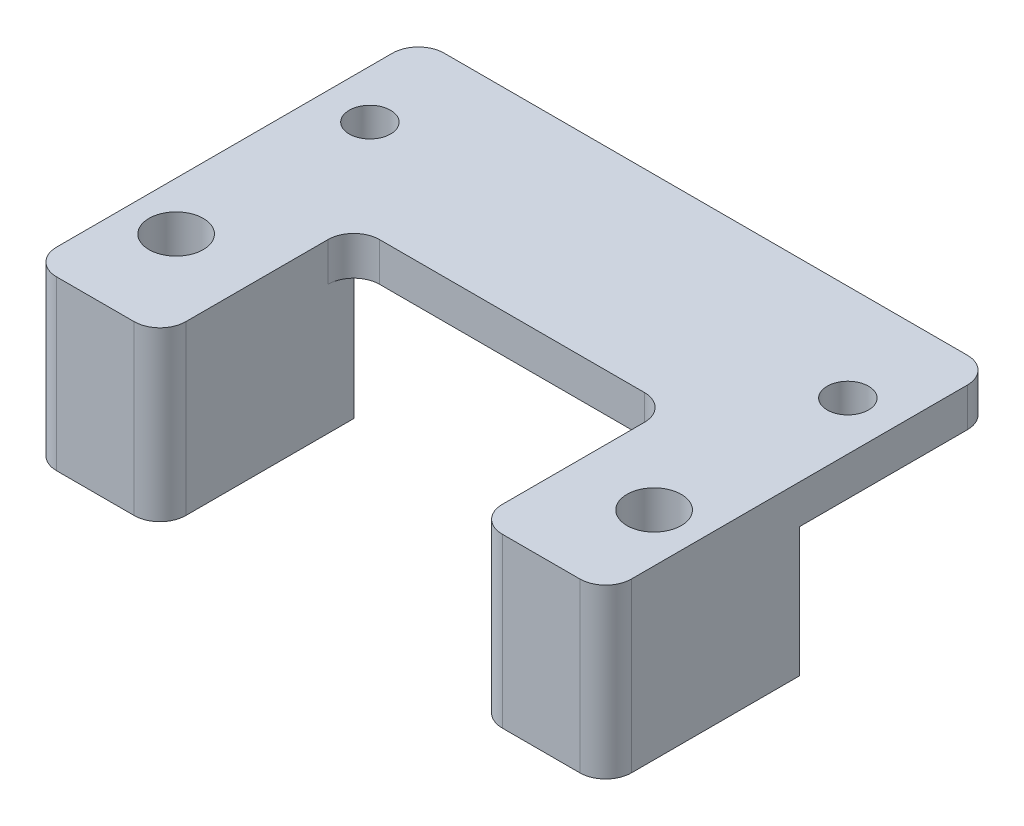
ISO-10303-21;
HEADER;
FILE_DESCRIPTION(('STEP AP214'),'2;1');
FILE_NAME('part.step','',(''),(''),'','','');
FILE_SCHEMA(('AUTOMOTIVE_DESIGN { 1 0 10303 214 1 1 1 1 }'));
ENDSEC;
DATA;
#1=APPLICATION_CONTEXT('core data for automotive mechanical design processes');
#2=APPLICATION_PROTOCOL_DEFINITION('international standard','automotive_design',2000,#1);
#3=PRODUCT_CONTEXT('',#1,'mechanical');
#4=PRODUCT('Part','Part','',(#3));
#5=PRODUCT_RELATED_PRODUCT_CATEGORY('part','',(#4));
#6=PRODUCT_DEFINITION_FORMATION('','',#4);
#7=PRODUCT_DEFINITION_CONTEXT('part definition',#1,'design');
#8=PRODUCT_DEFINITION('design','',#6,#7);
#9=PRODUCT_DEFINITION_SHAPE('','',#8);
#10=(LENGTH_UNIT() NAMED_UNIT(*) SI_UNIT(.MILLI.,.METRE.));
#11=(NAMED_UNIT(*) PLANE_ANGLE_UNIT() SI_UNIT($,.RADIAN.));
#12=(NAMED_UNIT(*) SI_UNIT($,.STERADIAN.) SOLID_ANGLE_UNIT());
#13=UNCERTAINTY_MEASURE_WITH_UNIT(LENGTH_MEASURE(1.E-05),#10,'distance_accuracy_value','');
#14=(GEOMETRIC_REPRESENTATION_CONTEXT(3) GLOBAL_UNCERTAINTY_ASSIGNED_CONTEXT((#13)) GLOBAL_UNIT_ASSIGNED_CONTEXT((#10,
#11,#12)) REPRESENTATION_CONTEXT('',''));
#15=CARTESIAN_POINT('',(0.,0.,0.));
#16=DIRECTION('',(0.,0.,1.));
#17=DIRECTION('',(1.,0.,0.));
#18=AXIS2_PLACEMENT_3D('',#15,#16,#17);
#19=CARTESIAN_POINT('',(0.,3.,0.));
#20=DIRECTION('',(0.,0.,-1.));
#21=DIRECTION('',(-1.,0.,0.));
#22=AXIS2_PLACEMENT_3D('',#19,#20,#21);
#23=PLANE('',#22);
#24=DIRECTION('',(-1.,0.,0.));
#25=VECTOR('',#24,1.);
#26=CARTESIAN_POINT('',(0.,-10.,0.));
#27=LINE('',#26,#25);
#28=CARTESIAN_POINT('',(8.,-10.,0.));
#29=VERTEX_POINT('',#28);
#30=CARTESIAN_POINT('',(2.,-10.,0.));
#31=VERTEX_POINT('',#30);
#32=EDGE_CURVE('E367',#29,#31,#27,.T.);
#33=ORIENTED_EDGE('',*,*,#32,.F.);
#34=DIRECTION('',(0.,1.,0.));
#35=VECTOR('',#34,1.);
#36=CARTESIAN_POINT('',(8.,3.,0.));
#37=LINE('',#36,#35);
#38=CARTESIAN_POINT('',(8.,3.,0.));
#39=VERTEX_POINT('',#38);
#40=EDGE_CURVE('E287',#29,#39,#37,.T.);
#41=ORIENTED_EDGE('',*,*,#40,.T.);
#42=DIRECTION('',(1.,0.,0.));
#43=VECTOR('',#42,1.);
#44=CARTESIAN_POINT('',(0.,3.,0.));
#45=LINE('',#44,#43);
#46=CARTESIAN_POINT('',(2.,3.,0.));
#47=VERTEX_POINT('',#46);
#48=EDGE_CURVE('E231',#47,#39,#45,.T.);
#49=ORIENTED_EDGE('',*,*,#48,.F.);
#50=DIRECTION('',(0.,-1.,0.));
#51=VECTOR('',#50,1.);
#52=CARTESIAN_POINT('',(2.,3.,0.));
#53=LINE('',#52,#51);
#54=EDGE_CURVE('E284',#47,#31,#53,.T.);
#55=ORIENTED_EDGE('',*,*,#54,.T.);
#56=EDGE_LOOP('',(#33,#41,#49,#55));
#57=FACE_BOUND('',#56,.T.);
#58=ADVANCED_FACE('F41',(#57),#23,.F.);
#59=CARTESIAN_POINT('',(0.,3.,0.));
#60=DIRECTION('',(1.,0.,0.));
#61=DIRECTION('',(0.,0.,-1.));
#62=AXIS2_PLACEMENT_3D('',#59,#60,#61);
#63=PLANE('',#62);
#64=DIRECTION('',(0.,0.,-1.));
#65=VECTOR('',#64,1.);
#66=CARTESIAN_POINT('',(0.,-10.,0.));
#67=LINE('',#66,#65);
#68=CARTESIAN_POINT('',(0.,-10.,-2.));
#69=VERTEX_POINT('',#68);
#70=CARTESIAN_POINT('',(0.,-10.,-15.));
#71=VERTEX_POINT('',#70);
#72=EDGE_CURVE('E360',#69,#71,#67,.T.);
#73=ORIENTED_EDGE('',*,*,#72,.F.);
#74=DIRECTION('',(0.,-1.,0.));
#75=VECTOR('',#74,1.);
#76=CARTESIAN_POINT('',(0.,3.,-2.));
#77=LINE('',#76,#75);
#78=CARTESIAN_POINT('',(0.,3.,-2.));
#79=VERTEX_POINT('',#78);
#80=EDGE_CURVE('E302',#69,#79,#77,.F.);
#81=ORIENTED_EDGE('',*,*,#80,.T.);
#82=DIRECTION('',(0.,0.,1.));
#83=VECTOR('',#82,1.);
#84=CARTESIAN_POINT('',(0.,3.,0.));
#85=LINE('',#84,#83);
#86=CARTESIAN_POINT('',(0.,3.,-28.));
#87=VERTEX_POINT('',#86);
#88=EDGE_CURVE('E224',#87,#79,#85,.T.);
#89=ORIENTED_EDGE('',*,*,#88,.F.);
#90=DIRECTION('',(0.,-1.,0.));
#91=VECTOR('',#90,1.);
#92=CARTESIAN_POINT('',(0.,3.,-28.));
#93=LINE('',#92,#91);
#94=CARTESIAN_POINT('',(0.,0.,-28.));
#95=VERTEX_POINT('',#94);
#96=EDGE_CURVE('E299',#87,#95,#93,.T.);
#97=ORIENTED_EDGE('',*,*,#96,.T.);
#98=DIRECTION('',(0.,0.,1.));
#99=VECTOR('',#98,1.);
#100=CARTESIAN_POINT('',(0.,0.,0.));
#101=LINE('',#100,#99);
#102=CARTESIAN_POINT('',(0.,0.,-15.));
#103=VERTEX_POINT('',#102);
#104=EDGE_CURVE('E238',#95,#103,#101,.T.);
#105=ORIENTED_EDGE('',*,*,#104,.T.);
#106=DIRECTION('',(0.,1.,0.));
#107=VECTOR('',#106,1.);
#108=CARTESIAN_POINT('',(0.,-10.,-15.));
#109=LINE('',#108,#107);
#110=EDGE_CURVE('E213',#71,#103,#109,.T.);
#111=ORIENTED_EDGE('',*,*,#110,.F.);
#112=EDGE_LOOP('',(#73,#81,#89,#97,#105,#111));
#113=FACE_BOUND('',#112,.T.);
#114=ADVANCED_FACE('F377',(#113),#63,.F.);
#115=CARTESIAN_POINT('',(36.5,3.,0.));
#116=VERTEX_POINT('',#115);
#117=CARTESIAN_POINT('',(42.5,3.,0.));
#118=VERTEX_POINT('',#117);
#119=EDGE_CURVE('E227',#116,#118,#45,.T.);
#120=ORIENTED_EDGE('',*,*,#119,.F.);
#121=DIRECTION('',(0.,1.,0.));
#122=VECTOR('',#121,1.);
#123=CARTESIAN_POINT('',(36.5,3.,0.));
#124=LINE('',#123,#122);
#125=CARTESIAN_POINT('',(36.5,-10.,0.));
#126=VERTEX_POINT('',#125);
#127=EDGE_CURVE('E273',#116,#126,#124,.F.);
#128=ORIENTED_EDGE('',*,*,#127,.T.);
#129=DIRECTION('',(-1.,0.,0.));
#130=VECTOR('',#129,1.);
#131=CARTESIAN_POINT('',(44.5,-10.,0.));
#132=LINE('',#131,#130);
#133=CARTESIAN_POINT('',(42.5,-10.,0.));
#134=VERTEX_POINT('',#133);
#135=EDGE_CURVE('E219',#134,#126,#132,.T.);
#136=ORIENTED_EDGE('',*,*,#135,.F.);
#137=DIRECTION('',(0.,-1.,0.));
#138=VECTOR('',#137,1.);
#139=CARTESIAN_POINT('',(42.5,3.,0.));
#140=LINE('',#139,#138);
#141=EDGE_CURVE('E271',#134,#118,#140,.F.);
#142=ORIENTED_EDGE('',*,*,#141,.T.);
#143=EDGE_LOOP('',(#120,#128,#136,#142));
#144=FACE_BOUND('',#143,.T.);
#145=ADVANCED_FACE('F408',(#144),#23,.F.);
#146=CARTESIAN_POINT('',(44.5,3.,0.));
#147=DIRECTION('',(-1.,0.,0.));
#148=DIRECTION('',(0.,0.,1.));
#149=AXIS2_PLACEMENT_3D('',#146,#147,#148);
#150=PLANE('',#149);
#151=DIRECTION('',(0.,0.,-1.));
#152=VECTOR('',#151,1.);
#153=CARTESIAN_POINT('',(44.5,3.,0.));
#154=LINE('',#153,#152);
#155=CARTESIAN_POINT('',(44.5,3.,-2.));
#156=VERTEX_POINT('',#155);
#157=CARTESIAN_POINT('',(44.5,3.,-28.));
#158=VERTEX_POINT('',#157);
#159=EDGE_CURVE('E232',#156,#158,#154,.T.);
#160=ORIENTED_EDGE('',*,*,#159,.F.);
#161=DIRECTION('',(0.,-1.,0.));
#162=VECTOR('',#161,1.);
#163=CARTESIAN_POINT('',(44.5,3.,-2.));
#164=LINE('',#163,#162);
#165=CARTESIAN_POINT('',(44.5,-10.,-2.));
#166=VERTEX_POINT('',#165);
#167=EDGE_CURVE('E296',#156,#166,#164,.T.);
#168=ORIENTED_EDGE('',*,*,#167,.T.);
#169=DIRECTION('',(0.,0.,1.));
#170=VECTOR('',#169,1.);
#171=CARTESIAN_POINT('',(44.5,-10.,0.));
#172=LINE('',#171,#170);
#173=CARTESIAN_POINT('',(44.5,-10.,-15.));
#174=VERTEX_POINT('',#173);
#175=EDGE_CURVE('E201',#174,#166,#172,.T.);
#176=ORIENTED_EDGE('',*,*,#175,.F.);
#177=DIRECTION('',(0.,1.,0.));
#178=VECTOR('',#177,1.);
#179=CARTESIAN_POINT('',(44.5,-10.,-15.));
#180=LINE('',#179,#178);
#181=CARTESIAN_POINT('',(44.5,0.,-15.));
#182=VERTEX_POINT('',#181);
#183=EDGE_CURVE('E205',#174,#182,#180,.T.);
#184=ORIENTED_EDGE('',*,*,#183,.T.);
#185=DIRECTION('',(0.,0.,-1.));
#186=VECTOR('',#185,1.);
#187=CARTESIAN_POINT('',(44.5,0.,0.));
#188=LINE('',#187,#186);
#189=CARTESIAN_POINT('',(44.5,0.,-28.));
#190=VERTEX_POINT('',#189);
#191=EDGE_CURVE('E196',#182,#190,#188,.T.);
#192=ORIENTED_EDGE('',*,*,#191,.T.);
#193=DIRECTION('',(0.,-1.,0.));
#194=VECTOR('',#193,1.);
#195=CARTESIAN_POINT('',(44.5,3.,-28.));
#196=LINE('',#195,#194);
#197=EDGE_CURVE('E294',#190,#158,#196,.F.);
#198=ORIENTED_EDGE('',*,*,#197,.T.);
#199=EDGE_LOOP('',(#160,#168,#176,#184,#192,#198));
#200=FACE_BOUND('',#199,.T.);
#201=ADVANCED_FACE('F394',(#200),#150,.F.);
#202=CARTESIAN_POINT('',(0.,3.,-30.));
#203=DIRECTION('',(0.,0.,1.));
#204=DIRECTION('',(1.,0.,0.));
#205=AXIS2_PLACEMENT_3D('',#202,#203,#204);
#206=PLANE('',#205);
#207=DIRECTION('',(-1.,0.,0.));
#208=VECTOR('',#207,1.);
#209=CARTESIAN_POINT('',(0.,0.,-30.));
#210=LINE('',#209,#208);
#211=CARTESIAN_POINT('',(42.5,0.,-30.));
#212=VERTEX_POINT('',#211);
#213=CARTESIAN_POINT('',(2.,0.,-30.));
#214=VERTEX_POINT('',#213);
#215=EDGE_CURVE('E228',#212,#214,#210,.T.);
#216=ORIENTED_EDGE('',*,*,#215,.T.);
#217=DIRECTION('',(0.,-1.,0.));
#218=VECTOR('',#217,1.);
#219=CARTESIAN_POINT('',(2.,3.,-30.));
#220=LINE('',#219,#218);
#221=CARTESIAN_POINT('',(2.,3.,-30.));
#222=VERTEX_POINT('',#221);
#223=EDGE_CURVE('E310',#214,#222,#220,.F.);
#224=ORIENTED_EDGE('',*,*,#223,.T.);
#225=DIRECTION('',(-1.,0.,0.));
#226=VECTOR('',#225,1.);
#227=CARTESIAN_POINT('',(0.,3.,-30.));
#228=LINE('',#227,#226);
#229=CARTESIAN_POINT('',(42.5,3.,-30.));
#230=VERTEX_POINT('',#229);
#231=EDGE_CURVE('E235',#230,#222,#228,.T.);
#232=ORIENTED_EDGE('',*,*,#231,.F.);
#233=DIRECTION('',(0.,-1.,0.));
#234=VECTOR('',#233,1.);
#235=CARTESIAN_POINT('',(42.5,3.,-30.));
#236=LINE('',#235,#234);
#237=EDGE_CURVE('E307',#230,#212,#236,.T.);
#238=ORIENTED_EDGE('',*,*,#237,.T.);
#239=EDGE_LOOP('',(#216,#224,#232,#238));
#240=FACE_BOUND('',#239,.T.);
#241=ADVANCED_FACE('F387',(#240),#206,.F.);
#242=CARTESIAN_POINT('',(0.,3.,0.));
#243=DIRECTION('',(0.,-1.,0.));
#244=DIRECTION('',(0.,0.,-1.));
#245=AXIS2_PLACEMENT_3D('',#242,#243,#244);
#246=PLANE('',#245);
#247=DIRECTION('',(0.,0.,1.));
#248=VECTOR('',#247,1.);
#249=CARTESIAN_POINT('',(34.5,3.,0.));
#250=LINE('',#249,#248);
#251=CARTESIAN_POINT('',(34.5,3.,-13.));
#252=VERTEX_POINT('',#251);
#253=CARTESIAN_POINT('',(34.5,3.,-2.));
#254=VERTEX_POINT('',#253);
#255=EDGE_CURVE('E343',#252,#254,#250,.T.);
#256=ORIENTED_EDGE('',*,*,#255,.T.);
#257=CARTESIAN_POINT('',(36.5,3.,-2.));
#258=DIRECTION('',(0.,-1.,0.));
#259=DIRECTION('',(0.,0.,-1.));
#260=AXIS2_PLACEMENT_3D('',#257,#258,#259);
#261=CIRCLE('',#260,2.);
#262=EDGE_CURVE('E269',#254,#116,#261,.F.);
#263=ORIENTED_EDGE('',*,*,#262,.T.);
#264=ORIENTED_EDGE('',*,*,#119,.T.);
#265=CARTESIAN_POINT('',(42.5,3.,-2.));
#266=DIRECTION('',(0.,-1.,0.));
#267=DIRECTION('',(0.,0.,-1.));
#268=AXIS2_PLACEMENT_3D('',#265,#266,#267);
#269=CIRCLE('',#268,2.);
#270=EDGE_CURVE('E265',#118,#156,#269,.F.);
#271=ORIENTED_EDGE('',*,*,#270,.T.);
#272=ORIENTED_EDGE('',*,*,#159,.T.);
#273=CARTESIAN_POINT('',(42.5,3.,-28.));
#274=DIRECTION('',(0.,-1.,0.));
#275=DIRECTION('',(0.,0.,-1.));
#276=AXIS2_PLACEMENT_3D('',#273,#274,#275);
#277=CIRCLE('',#276,2.);
#278=EDGE_CURVE('E259',#158,#230,#277,.F.);
#279=ORIENTED_EDGE('',*,*,#278,.T.);
#280=ORIENTED_EDGE('',*,*,#231,.T.);
#281=CARTESIAN_POINT('',(2.,3.,-28.));
#282=DIRECTION('',(0.,-1.,0.));
#283=DIRECTION('',(0.,0.,-1.));
#284=AXIS2_PLACEMENT_3D('',#281,#282,#283);
#285=CIRCLE('',#284,2.);
#286=EDGE_CURVE('E261',#222,#87,#285,.F.);
#287=ORIENTED_EDGE('',*,*,#286,.T.);
#288=ORIENTED_EDGE('',*,*,#88,.T.);
#289=CARTESIAN_POINT('',(2.,3.,-2.));
#290=DIRECTION('',(0.,-1.,0.));
#291=DIRECTION('',(0.,0.,-1.));
#292=AXIS2_PLACEMENT_3D('',#289,#290,#291);
#293=CIRCLE('',#292,2.);
#294=EDGE_CURVE('E263',#79,#47,#293,.F.);
#295=ORIENTED_EDGE('',*,*,#294,.T.);
#296=ORIENTED_EDGE('',*,*,#48,.T.);
#297=CARTESIAN_POINT('',(8.,3.,-2.));
#298=DIRECTION('',(0.,-1.,0.));
#299=DIRECTION('',(0.,0.,-1.));
#300=AXIS2_PLACEMENT_3D('',#297,#298,#299);
#301=CIRCLE('',#300,2.);
#302=CARTESIAN_POINT('',(10.,3.,-2.));
#303=VERTEX_POINT('',#302);
#304=EDGE_CURVE('E267',#39,#303,#301,.F.);
#305=ORIENTED_EDGE('',*,*,#304,.T.);
#306=DIRECTION('',(0.,0.,-1.));
#307=VECTOR('',#306,1.);
#308=CARTESIAN_POINT('',(10.,3.,0.));
#309=LINE('',#308,#307);
#310=CARTESIAN_POINT('',(10.,3.,-13.));
#311=VERTEX_POINT('',#310);
#312=EDGE_CURVE('E339',#303,#311,#309,.T.);
#313=ORIENTED_EDGE('',*,*,#312,.T.);
#314=CARTESIAN_POINT('',(12.,3.,-13.));
#315=DIRECTION('',(0.,-1.,0.));
#316=DIRECTION('',(0.,0.,-1.));
#317=AXIS2_PLACEMENT_3D('',#314,#315,#316);
#318=CIRCLE('',#317,2.);
#319=CARTESIAN_POINT('',(12.,3.,-15.));
#320=VERTEX_POINT('',#319);
#321=EDGE_CURVE('E11',#311,#320,#318,.T.);
#322=ORIENTED_EDGE('',*,*,#321,.T.);
#323=DIRECTION('',(1.,0.,0.));
#324=VECTOR('',#323,1.);
#325=CARTESIAN_POINT('',(0.,3.,-15.));
#326=LINE('',#325,#324);
#327=CARTESIAN_POINT('',(32.5,3.,-15.));
#328=VERTEX_POINT('',#327);
#329=EDGE_CURVE('E337',#320,#328,#326,.T.);
#330=ORIENTED_EDGE('',*,*,#329,.T.);
#331=CARTESIAN_POINT('',(32.5,3.,-13.));
#332=DIRECTION('',(0.,-1.,0.));
#333=DIRECTION('',(0.,0.,-1.));
#334=AXIS2_PLACEMENT_3D('',#331,#332,#333);
#335=CIRCLE('',#334,2.);
#336=EDGE_CURVE('E314',#328,#252,#335,.T.);
#337=ORIENTED_EDGE('',*,*,#336,.T.);
#338=EDGE_LOOP('',(#256,#263,#264,#271,#272,#279,#280,#287,#288,#295,#296,#305,#313,#322,#330,#337));
#339=FACE_BOUND('',#338,.T.);
#340=CARTESIAN_POINT('',(3.74999999999997,3.,-22.5));
#341=DIRECTION('',(0.,1.,0.));
#342=DIRECTION('',(0.,0.,1.));
#343=AXIS2_PLACEMENT_3D('',#340,#341,#342);
#344=CIRCLE('',#343,1.6);
#345=CARTESIAN_POINT('',(3.74999999999997,3.,-20.9));
#346=VERTEX_POINT('',#345);
#347=EDGE_CURVE('E349',#346,#346,#344,.T.);
#348=ORIENTED_EDGE('',*,*,#347,.F.);
#349=EDGE_LOOP('',(#348));
#350=FACE_BOUND('',#349,.T.);
#351=CARTESIAN_POINT('',(40.75,3.,-22.5));
#352=DIRECTION('',(0.,1.,0.));
#353=DIRECTION('',(0.,0.,1.));
#354=AXIS2_PLACEMENT_3D('',#351,#352,#353);
#355=CIRCLE('',#354,1.6);
#356=CARTESIAN_POINT('',(40.75,3.,-20.9));
#357=VERTEX_POINT('',#356);
#358=EDGE_CURVE('E353',#357,#357,#355,.T.);
#359=ORIENTED_EDGE('',*,*,#358,.F.);
#360=EDGE_LOOP('',(#359));
#361=FACE_BOUND('',#360,.T.);
#362=CARTESIAN_POINT('',(40.75,3.,-7.5));
#363=DIRECTION('',(0.,1.,0.));
#364=DIRECTION('',(0.,0.,1.));
#365=AXIS2_PLACEMENT_3D('',#362,#363,#364);
#366=CIRCLE('',#365,2.1);
#367=CARTESIAN_POINT('',(40.75,3.,-5.4));
#368=VERTEX_POINT('',#367);
#369=EDGE_CURVE('E350',#368,#368,#366,.T.);
#370=ORIENTED_EDGE('',*,*,#369,.F.);
#371=EDGE_LOOP('',(#370));
#372=FACE_BOUND('',#371,.T.);
#373=CARTESIAN_POINT('',(3.75,3.,-7.5));
#374=DIRECTION('',(0.,1.,0.));
#375=DIRECTION('',(0.,0.,1.));
#376=AXIS2_PLACEMENT_3D('',#373,#374,#375);
#377=CIRCLE('',#376,2.1);
#378=CARTESIAN_POINT('',(3.75,3.,-5.4));
#379=VERTEX_POINT('',#378);
#380=EDGE_CURVE('E246',#379,#379,#377,.T.);
#381=ORIENTED_EDGE('',*,*,#380,.F.);
#382=EDGE_LOOP('',(#381));
#383=FACE_BOUND('',#382,.T.);
#384=ADVANCED_FACE('F335',(#339,#350,#361,#372,#383),#246,.F.);
#385=CARTESIAN_POINT('',(0.,0.,0.));
#386=DIRECTION('',(0.,-1.,0.));
#387=DIRECTION('',(0.,0.,-1.));
#388=AXIS2_PLACEMENT_3D('',#385,#386,#387);
#389=PLANE('',#388);
#390=ORIENTED_EDGE('',*,*,#104,.F.);
#391=CARTESIAN_POINT('',(2.,0.,-28.));
#392=DIRECTION('',(0.,-1.,0.));
#393=DIRECTION('',(0.,0.,-1.));
#394=AXIS2_PLACEMENT_3D('',#391,#392,#393);
#395=CIRCLE('',#394,2.);
#396=EDGE_CURVE('E63',#95,#214,#395,.T.);
#397=ORIENTED_EDGE('',*,*,#396,.T.);
#398=ORIENTED_EDGE('',*,*,#215,.F.);
#399=CARTESIAN_POINT('',(42.5,0.,-28.));
#400=DIRECTION('',(0.,-1.,0.));
#401=DIRECTION('',(0.,0.,-1.));
#402=AXIS2_PLACEMENT_3D('',#399,#400,#401);
#403=CIRCLE('',#402,2.);
#404=EDGE_CURVE('E304',#212,#190,#403,.T.);
#405=ORIENTED_EDGE('',*,*,#404,.T.);
#406=ORIENTED_EDGE('',*,*,#191,.F.);
#407=DIRECTION('',(1.,0.,0.));
#408=VECTOR('',#407,1.);
#409=CARTESIAN_POINT('',(44.5,0.,-15.));
#410=LINE('',#409,#408);
#411=CARTESIAN_POINT('',(34.5,0.,-15.));
#412=VERTEX_POINT('',#411);
#413=EDGE_CURVE('E192',#412,#182,#410,.T.);
#414=ORIENTED_EDGE('',*,*,#413,.F.);
#415=DIRECTION('',(0.,0.,-1.));
#416=VECTOR('',#415,1.);
#417=CARTESIAN_POINT('',(34.5,0.,0.));
#418=LINE('',#417,#416);
#419=CARTESIAN_POINT('',(34.5,0.,-13.));
#420=VERTEX_POINT('',#419);
#421=EDGE_CURVE('E179',#420,#412,#418,.T.);
#422=ORIENTED_EDGE('',*,*,#421,.F.);
#423=CARTESIAN_POINT('',(32.5,0.,-13.));
#424=DIRECTION('',(0.,-1.,0.));
#425=DIRECTION('',(0.,0.,-1.));
#426=AXIS2_PLACEMENT_3D('',#423,#424,#425);
#427=CIRCLE('',#426,2.);
#428=CARTESIAN_POINT('',(32.5,0.,-15.));
#429=VERTEX_POINT('',#428);
#430=EDGE_CURVE('E312',#420,#429,#427,.F.);
#431=ORIENTED_EDGE('',*,*,#430,.T.);
#432=DIRECTION('',(1.,0.,0.));
#433=VECTOR('',#432,1.);
#434=CARTESIAN_POINT('',(10.,0.,-15.));
#435=LINE('',#434,#433);
#436=CARTESIAN_POINT('',(12.,0.,-15.));
#437=VERTEX_POINT('',#436);
#438=EDGE_CURVE('E317',#437,#429,#435,.T.);
#439=ORIENTED_EDGE('',*,*,#438,.F.);
#440=CARTESIAN_POINT('',(12.,0.,-13.));
#441=DIRECTION('',(0.,-1.,0.));
#442=DIRECTION('',(0.,0.,-1.));
#443=AXIS2_PLACEMENT_3D('',#440,#441,#442);
#444=CIRCLE('',#443,2.);
#445=CARTESIAN_POINT('',(10.,0.,-13.));
#446=VERTEX_POINT('',#445);
#447=EDGE_CURVE('E49',#437,#446,#444,.F.);
#448=ORIENTED_EDGE('',*,*,#447,.T.);
#449=DIRECTION('',(0.,0.,1.));
#450=VECTOR('',#449,1.);
#451=CARTESIAN_POINT('',(10.,0.,0.));
#452=LINE('',#451,#450);
#453=CARTESIAN_POINT('',(10.,0.,-15.));
#454=VERTEX_POINT('',#453);
#455=EDGE_CURVE('E56',#454,#446,#452,.T.);
#456=ORIENTED_EDGE('',*,*,#455,.F.);
#457=DIRECTION('',(1.,0.,0.));
#458=VECTOR('',#457,1.);
#459=CARTESIAN_POINT('',(0.,0.,-15.));
#460=LINE('',#459,#458);
#461=EDGE_CURVE('E200',#103,#454,#460,.T.);
#462=ORIENTED_EDGE('',*,*,#461,.F.);
#463=EDGE_LOOP('',(#390,#397,#398,#405,#406,#414,#422,#431,#439,#448,#456,#462));
#464=FACE_BOUND('',#463,.T.);
#465=CARTESIAN_POINT('',(3.74999999999997,0.,-22.5));
#466=DIRECTION('',(0.,-1.,0.));
#467=DIRECTION('',(0.,0.,-1.));
#468=AXIS2_PLACEMENT_3D('',#465,#466,#467);
#469=CIRCLE('',#468,1.6);
#470=CARTESIAN_POINT('',(3.74999999999997,0.,-24.1));
#471=VERTEX_POINT('',#470);
#472=EDGE_CURVE('E206',#471,#471,#469,.T.);
#473=ORIENTED_EDGE('',*,*,#472,.F.);
#474=EDGE_LOOP('',(#473));
#475=FACE_BOUND('',#474,.T.);
#476=CARTESIAN_POINT('',(40.75,0.,-22.5));
#477=DIRECTION('',(0.,-1.,0.));
#478=DIRECTION('',(0.,0.,-1.));
#479=AXIS2_PLACEMENT_3D('',#476,#477,#478);
#480=CIRCLE('',#479,1.6);
#481=CARTESIAN_POINT('',(40.75,0.,-24.1));
#482=VERTEX_POINT('',#481);
#483=EDGE_CURVE('E210',#482,#482,#480,.T.);
#484=ORIENTED_EDGE('',*,*,#483,.F.);
#485=EDGE_LOOP('',(#484));
#486=FACE_BOUND('',#485,.T.);
#487=ADVANCED_FACE('F193',(#464,#475,#486),#389,.T.);
#488=CARTESIAN_POINT('',(34.5,-10.,0.));
#489=DIRECTION('',(1.,0.,0.));
#490=DIRECTION('',(0.,0.,-1.));
#491=AXIS2_PLACEMENT_3D('',#488,#489,#490);
#492=PLANE('',#491);
#493=ORIENTED_EDGE('',*,*,#255,.F.);
#494=DIRECTION('',(0.,-1.,0.));
#495=VECTOR('',#494,1.);
#496=CARTESIAN_POINT('',(34.5,0.,-13.));
#497=LINE('',#496,#495);
#498=EDGE_CURVE('E188',#252,#420,#497,.T.);
#499=ORIENTED_EDGE('',*,*,#498,.T.);
#500=ORIENTED_EDGE('',*,*,#421,.T.);
#501=DIRECTION('',(0.,1.,0.));
#502=VECTOR('',#501,1.);
#503=CARTESIAN_POINT('',(34.5,-10.,-15.));
#504=LINE('',#503,#502);
#505=CARTESIAN_POINT('',(34.5,-10.,-15.));
#506=VERTEX_POINT('',#505);
#507=EDGE_CURVE('E185',#506,#412,#504,.T.);
#508=ORIENTED_EDGE('',*,*,#507,.F.);
#509=DIRECTION('',(0.,0.,-1.));
#510=VECTOR('',#509,1.);
#511=CARTESIAN_POINT('',(34.5,-10.,0.));
#512=LINE('',#511,#510);
#513=CARTESIAN_POINT('',(34.5,-10.,-2.));
#514=VERTEX_POINT('',#513);
#515=EDGE_CURVE('E217',#514,#506,#512,.T.);
#516=ORIENTED_EDGE('',*,*,#515,.F.);
#517=DIRECTION('',(0.,1.,0.));
#518=VECTOR('',#517,1.);
#519=CARTESIAN_POINT('',(34.5,-10.,-2.));
#520=LINE('',#519,#518);
#521=EDGE_CURVE('E189',#514,#254,#520,.T.);
#522=ORIENTED_EDGE('',*,*,#521,.T.);
#523=EDGE_LOOP('',(#493,#499,#500,#508,#516,#522));
#524=FACE_BOUND('',#523,.T.);
#525=ADVANCED_FACE('F182',(#524),#492,.F.);
#526=CARTESIAN_POINT('',(44.5,-10.,-15.));
#527=DIRECTION('',(0.,0.,1.));
#528=DIRECTION('',(1.,0.,0.));
#529=AXIS2_PLACEMENT_3D('',#526,#527,#528);
#530=PLANE('',#529);
#531=ORIENTED_EDGE('',*,*,#413,.T.);
#532=ORIENTED_EDGE('',*,*,#183,.F.);
#533=DIRECTION('',(1.,0.,0.));
#534=VECTOR('',#533,1.);
#535=CARTESIAN_POINT('',(44.5,-10.,-15.));
#536=LINE('',#535,#534);
#537=EDGE_CURVE('E204',#506,#174,#536,.T.);
#538=ORIENTED_EDGE('',*,*,#537,.F.);
#539=ORIENTED_EDGE('',*,*,#507,.T.);
#540=EDGE_LOOP('',(#531,#532,#538,#539));
#541=FACE_BOUND('',#540,.T.);
#542=ADVANCED_FACE('F203',(#541),#530,.F.);
#543=CARTESIAN_POINT('',(0.,-10.,0.));
#544=DIRECTION('',(0.,1.,0.));
#545=DIRECTION('',(0.,0.,1.));
#546=AXIS2_PLACEMENT_3D('',#543,#544,#545);
#547=PLANE('',#546);
#548=CARTESIAN_POINT('',(40.75,-10.,-7.5));
#549=DIRECTION('',(0.,1.,0.));
#550=DIRECTION('',(0.,0.,1.));
#551=AXIS2_PLACEMENT_3D('',#548,#549,#550);
#552=CIRCLE('',#551,2.1);
#553=CARTESIAN_POINT('',(40.75,-10.,-5.4));
#554=VERTEX_POINT('',#553);
#555=EDGE_CURVE('E245',#554,#554,#552,.T.);
#556=ORIENTED_EDGE('',*,*,#555,.T.);
#557=EDGE_LOOP('',(#556));
#558=FACE_BOUND('',#557,.T.);
#559=ORIENTED_EDGE('',*,*,#135,.T.);
#560=CARTESIAN_POINT('',(36.5,-10.,-2.));
#561=DIRECTION('',(0.,1.,0.));
#562=DIRECTION('',(0.,0.,1.));
#563=AXIS2_PLACEMENT_3D('',#560,#561,#562);
#564=CIRCLE('',#563,2.);
#565=EDGE_CURVE('E277',#126,#514,#564,.F.);
#566=ORIENTED_EDGE('',*,*,#565,.T.);
#567=ORIENTED_EDGE('',*,*,#515,.T.);
#568=ORIENTED_EDGE('',*,*,#537,.T.);
#569=ORIENTED_EDGE('',*,*,#175,.T.);
#570=CARTESIAN_POINT('',(42.5,-10.,-2.));
#571=DIRECTION('',(0.,1.,0.));
#572=DIRECTION('',(0.,0.,1.));
#573=AXIS2_PLACEMENT_3D('',#570,#571,#572);
#574=CIRCLE('',#573,2.);
#575=EDGE_CURVE('E275',#166,#134,#574,.F.);
#576=ORIENTED_EDGE('',*,*,#575,.T.);
#577=EDGE_LOOP('',(#559,#566,#567,#568,#569,#576));
#578=FACE_BOUND('',#577,.T.);
#579=ADVANCED_FACE('F398',(#558,#578),#547,.F.);
#580=CARTESIAN_POINT('',(0.,-10.,-15.));
#581=DIRECTION('',(0.,0.,1.));
#582=DIRECTION('',(1.,0.,0.));
#583=AXIS2_PLACEMENT_3D('',#580,#581,#582);
#584=PLANE('',#583);
#585=ORIENTED_EDGE('',*,*,#461,.T.);
#586=DIRECTION('',(0.,1.,0.));
#587=VECTOR('',#586,1.);
#588=CARTESIAN_POINT('',(10.,-10.,-15.));
#589=LINE('',#588,#587);
#590=CARTESIAN_POINT('',(10.,-10.,-15.));
#591=VERTEX_POINT('',#590);
#592=EDGE_CURVE('E327',#591,#454,#589,.T.);
#593=ORIENTED_EDGE('',*,*,#592,.F.);
#594=DIRECTION('',(1.,0.,0.));
#595=VECTOR('',#594,1.);
#596=CARTESIAN_POINT('',(0.,-10.,-15.));
#597=LINE('',#596,#595);
#598=EDGE_CURVE('E362',#71,#591,#597,.T.);
#599=ORIENTED_EDGE('',*,*,#598,.F.);
#600=ORIENTED_EDGE('',*,*,#110,.T.);
#601=EDGE_LOOP('',(#585,#593,#599,#600));
#602=FACE_BOUND('',#601,.T.);
#603=ADVANCED_FACE('F374',(#602),#584,.F.);
#604=CARTESIAN_POINT('',(10.,-10.,0.));
#605=DIRECTION('',(-1.,0.,0.));
#606=DIRECTION('',(0.,0.,1.));
#607=AXIS2_PLACEMENT_3D('',#604,#605,#606);
#608=PLANE('',#607);
#609=ORIENTED_EDGE('',*,*,#592,.T.);
#610=ORIENTED_EDGE('',*,*,#455,.T.);
#611=DIRECTION('',(0.,-1.,0.));
#612=VECTOR('',#611,1.);
#613=CARTESIAN_POINT('',(10.,3.,-13.));
#614=LINE('',#613,#612);
#615=EDGE_CURVE('E281',#446,#311,#614,.F.);
#616=ORIENTED_EDGE('',*,*,#615,.T.);
#617=ORIENTED_EDGE('',*,*,#312,.F.);
#618=DIRECTION('',(0.,1.,0.));
#619=VECTOR('',#618,1.);
#620=CARTESIAN_POINT('',(10.,-10.,-2.));
#621=LINE('',#620,#619);
#622=CARTESIAN_POINT('',(10.,-10.,-2.));
#623=VERTEX_POINT('',#622);
#624=EDGE_CURVE('E279',#303,#623,#621,.F.);
#625=ORIENTED_EDGE('',*,*,#624,.T.);
#626=DIRECTION('',(0.,0.,1.));
#627=VECTOR('',#626,1.);
#628=CARTESIAN_POINT('',(10.,-10.,0.));
#629=LINE('',#628,#627);
#630=EDGE_CURVE('E364',#591,#623,#629,.T.);
#631=ORIENTED_EDGE('',*,*,#630,.F.);
#632=EDGE_LOOP('',(#609,#610,#616,#617,#625,#631));
#633=FACE_BOUND('',#632,.T.);
#634=ADVANCED_FACE('F322',(#633),#608,.F.);
#635=CARTESIAN_POINT('',(0.,-10.,0.));
#636=DIRECTION('',(0.,-1.,0.));
#637=DIRECTION('',(0.,0.,-1.));
#638=AXIS2_PLACEMENT_3D('',#635,#636,#637);
#639=PLANE('',#638);
#640=CARTESIAN_POINT('',(3.75,-10.,-7.5));
#641=DIRECTION('',(0.,-1.,0.));
#642=DIRECTION('',(0.,0.,-1.));
#643=AXIS2_PLACEMENT_3D('',#640,#641,#642);
#644=CIRCLE('',#643,2.1);
#645=CARTESIAN_POINT('',(3.75,-10.,-9.6));
#646=VERTEX_POINT('',#645);
#647=EDGE_CURVE('E242',#646,#646,#644,.T.);
#648=ORIENTED_EDGE('',*,*,#647,.F.);
#649=EDGE_LOOP('',(#648));
#650=FACE_BOUND('',#649,.T.);
#651=ORIENTED_EDGE('',*,*,#630,.T.);
#652=CARTESIAN_POINT('',(8.,-10.,-2.));
#653=DIRECTION('',(0.,-1.,0.));
#654=DIRECTION('',(0.,0.,-1.));
#655=AXIS2_PLACEMENT_3D('',#652,#653,#654);
#656=CIRCLE('',#655,2.);
#657=EDGE_CURVE('E292',#623,#29,#656,.T.);
#658=ORIENTED_EDGE('',*,*,#657,.T.);
#659=ORIENTED_EDGE('',*,*,#32,.T.);
#660=CARTESIAN_POINT('',(2.,-10.,-2.));
#661=DIRECTION('',(0.,-1.,0.));
#662=DIRECTION('',(0.,0.,-1.));
#663=AXIS2_PLACEMENT_3D('',#660,#661,#662);
#664=CIRCLE('',#663,2.);
#665=EDGE_CURVE('E290',#31,#69,#664,.T.);
#666=ORIENTED_EDGE('',*,*,#665,.T.);
#667=ORIENTED_EDGE('',*,*,#72,.T.);
#668=ORIENTED_EDGE('',*,*,#598,.T.);
#669=EDGE_LOOP('',(#651,#658,#659,#666,#667,#668));
#670=FACE_BOUND('',#669,.T.);
#671=ADVANCED_FACE('F457',(#650,#670),#639,.T.);
#672=CARTESIAN_POINT('',(3.75,-42.,-7.5));
#673=DIRECTION('',(0.,1.,0.));
#674=DIRECTION('',(0.,0.,1.));
#675=AXIS2_PLACEMENT_3D('',#672,#673,#674);
#676=CYLINDRICAL_SURFACE('',#675,2.1);
#677=ORIENTED_EDGE('',*,*,#647,.T.);
#678=EDGE_LOOP('',(#677));
#679=FACE_BOUND('',#678,.T.);
#680=ORIENTED_EDGE('',*,*,#380,.T.);
#681=EDGE_LOOP('',(#680));
#682=FACE_BOUND('',#681,.T.);
#683=ADVANCED_FACE('F460',(#679,#682),#676,.F.);
#684=CARTESIAN_POINT('',(40.75,-42.,-7.5));
#685=DIRECTION('',(0.,1.,0.));
#686=DIRECTION('',(0.,0.,1.));
#687=AXIS2_PLACEMENT_3D('',#684,#685,#686);
#688=CYLINDRICAL_SURFACE('',#687,2.1);
#689=ORIENTED_EDGE('',*,*,#369,.T.);
#690=EDGE_LOOP('',(#689));
#691=FACE_BOUND('',#690,.T.);
#692=ORIENTED_EDGE('',*,*,#555,.F.);
#693=EDGE_LOOP('',(#692));
#694=FACE_BOUND('',#693,.T.);
#695=ADVANCED_FACE('F464',(#691,#694),#688,.F.);
#696=CARTESIAN_POINT('',(40.75,-42.,-22.5));
#697=DIRECTION('',(0.,1.,0.));
#698=DIRECTION('',(0.,0.,1.));
#699=AXIS2_PLACEMENT_3D('',#696,#697,#698);
#700=CYLINDRICAL_SURFACE('',#699,1.6);
#701=ORIENTED_EDGE('',*,*,#483,.T.);
#702=EDGE_LOOP('',(#701));
#703=FACE_BOUND('',#702,.T.);
#704=ORIENTED_EDGE('',*,*,#358,.T.);
#705=EDGE_LOOP('',(#704));
#706=FACE_BOUND('',#705,.T.);
#707=ADVANCED_FACE('F469',(#703,#706),#700,.F.);
#708=CARTESIAN_POINT('',(3.74999999999997,-42.,-22.5));
#709=DIRECTION('',(0.,1.,0.));
#710=DIRECTION('',(0.,0.,1.));
#711=AXIS2_PLACEMENT_3D('',#708,#709,#710);
#712=CYLINDRICAL_SURFACE('',#711,1.6);
#713=ORIENTED_EDGE('',*,*,#472,.T.);
#714=EDGE_LOOP('',(#713));
#715=FACE_BOUND('',#714,.T.);
#716=ORIENTED_EDGE('',*,*,#347,.T.);
#717=EDGE_LOOP('',(#716));
#718=FACE_BOUND('',#717,.T.);
#719=ADVANCED_FACE('F466',(#715,#718),#712,.F.);
#720=CARTESIAN_POINT('',(10.,10.,-15.));
#721=DIRECTION('',(0.,0.,-1.));
#722=DIRECTION('',(-1.,0.,0.));
#723=AXIS2_PLACEMENT_3D('',#720,#721,#722);
#724=PLANE('',#723);
#725=ORIENTED_EDGE('',*,*,#438,.T.);
#726=DIRECTION('',(0.,-1.,0.));
#727=VECTOR('',#726,1.);
#728=CARTESIAN_POINT('',(32.5,3.,-15.));
#729=LINE('',#728,#727);
#730=EDGE_CURVE('E257',#429,#328,#729,.F.);
#731=ORIENTED_EDGE('',*,*,#730,.T.);
#732=ORIENTED_EDGE('',*,*,#329,.F.);
#733=DIRECTION('',(0.,-1.,0.));
#734=VECTOR('',#733,1.);
#735=CARTESIAN_POINT('',(12.,0.,-15.));
#736=LINE('',#735,#734);
#737=EDGE_CURVE('E254',#320,#437,#736,.T.);
#738=ORIENTED_EDGE('',*,*,#737,.T.);
#739=EDGE_LOOP('',(#725,#731,#732,#738));
#740=FACE_BOUND('',#739,.T.);
#741=ADVANCED_FACE('F341',(#740),#724,.F.);
#742=CARTESIAN_POINT('',(32.5,-10.,-13.));
#743=DIRECTION('',(0.,1.,0.));
#744=DIRECTION('',(0.,0.,1.));
#745=AXIS2_PLACEMENT_3D('',#742,#743,#744);
#746=CYLINDRICAL_SURFACE('',#745,2.);
#747=ORIENTED_EDGE('',*,*,#336,.F.);
#748=ORIENTED_EDGE('',*,*,#730,.F.);
#749=ORIENTED_EDGE('',*,*,#430,.F.);
#750=ORIENTED_EDGE('',*,*,#498,.F.);
#751=EDGE_LOOP('',(#747,#748,#749,#750));
#752=FACE_BOUND('',#751,.T.);
#753=ADVANCED_FACE('F478',(#752),#746,.F.);
#754=CARTESIAN_POINT('',(36.5,-10.,-2.));
#755=DIRECTION('',(0.,1.,0.));
#756=DIRECTION('',(0.,0.,1.));
#757=AXIS2_PLACEMENT_3D('',#754,#755,#756);
#758=CYLINDRICAL_SURFACE('',#757,2.);
#759=ORIENTED_EDGE('',*,*,#565,.F.);
#760=ORIENTED_EDGE('',*,*,#127,.F.);
#761=ORIENTED_EDGE('',*,*,#262,.F.);
#762=ORIENTED_EDGE('',*,*,#521,.F.);
#763=EDGE_LOOP('',(#759,#760,#761,#762));
#764=FACE_BOUND('',#763,.T.);
#765=ADVANCED_FACE('F403',(#764),#758,.T.);
#766=CARTESIAN_POINT('',(12.,10.,-13.));
#767=DIRECTION('',(0.,1.,0.));
#768=DIRECTION('',(0.,0.,1.));
#769=AXIS2_PLACEMENT_3D('',#766,#767,#768);
#770=CYLINDRICAL_SURFACE('',#769,2.);
#771=ORIENTED_EDGE('',*,*,#321,.F.);
#772=ORIENTED_EDGE('',*,*,#615,.F.);
#773=ORIENTED_EDGE('',*,*,#447,.F.);
#774=ORIENTED_EDGE('',*,*,#737,.F.);
#775=EDGE_LOOP('',(#771,#772,#773,#774));
#776=FACE_BOUND('',#775,.T.);
#777=ADVANCED_FACE('F330',(#776),#770,.F.);
#778=CARTESIAN_POINT('',(8.,3.,-2.));
#779=DIRECTION('',(0.,1.,0.));
#780=DIRECTION('',(0.,0.,1.));
#781=AXIS2_PLACEMENT_3D('',#778,#779,#780);
#782=CYLINDRICAL_SURFACE('',#781,2.);
#783=ORIENTED_EDGE('',*,*,#657,.F.);
#784=ORIENTED_EDGE('',*,*,#624,.F.);
#785=ORIENTED_EDGE('',*,*,#304,.F.);
#786=ORIENTED_EDGE('',*,*,#40,.F.);
#787=EDGE_LOOP('',(#783,#784,#785,#786));
#788=FACE_BOUND('',#787,.T.);
#789=ADVANCED_FACE('F414',(#788),#782,.T.);
#790=CARTESIAN_POINT('',(42.5,3.,-2.));
#791=DIRECTION('',(0.,-1.,0.));
#792=DIRECTION('',(0.,0.,-1.));
#793=AXIS2_PLACEMENT_3D('',#790,#791,#792);
#794=CYLINDRICAL_SURFACE('',#793,2.);
#795=ORIENTED_EDGE('',*,*,#270,.F.);
#796=ORIENTED_EDGE('',*,*,#141,.F.);
#797=ORIENTED_EDGE('',*,*,#575,.F.);
#798=ORIENTED_EDGE('',*,*,#167,.F.);
#799=EDGE_LOOP('',(#795,#796,#797,#798));
#800=FACE_BOUND('',#799,.T.);
#801=ADVANCED_FACE('F411',(#800),#794,.T.);
#802=CARTESIAN_POINT('',(2.,3.,-2.));
#803=DIRECTION('',(0.,-1.,0.));
#804=DIRECTION('',(0.,0.,-1.));
#805=AXIS2_PLACEMENT_3D('',#802,#803,#804);
#806=CYLINDRICAL_SURFACE('',#805,2.);
#807=ORIENTED_EDGE('',*,*,#294,.F.);
#808=ORIENTED_EDGE('',*,*,#80,.F.);
#809=ORIENTED_EDGE('',*,*,#665,.F.);
#810=ORIENTED_EDGE('',*,*,#54,.F.);
#811=EDGE_LOOP('',(#807,#808,#809,#810));
#812=FACE_BOUND('',#811,.T.);
#813=ADVANCED_FACE('F413',(#812),#806,.T.);
#814=CARTESIAN_POINT('',(2.,3.,-28.));
#815=DIRECTION('',(0.,-1.,0.));
#816=DIRECTION('',(0.,0.,-1.));
#817=AXIS2_PLACEMENT_3D('',#814,#815,#816);
#818=CYLINDRICAL_SURFACE('',#817,2.);
#819=ORIENTED_EDGE('',*,*,#286,.F.);
#820=ORIENTED_EDGE('',*,*,#223,.F.);
#821=ORIENTED_EDGE('',*,*,#396,.F.);
#822=ORIENTED_EDGE('',*,*,#96,.F.);
#823=EDGE_LOOP('',(#819,#820,#821,#822));
#824=FACE_BOUND('',#823,.T.);
#825=ADVANCED_FACE('F383',(#824),#818,.T.);
#826=CARTESIAN_POINT('',(42.5,3.,-28.));
#827=DIRECTION('',(0.,-1.,0.));
#828=DIRECTION('',(0.,0.,-1.));
#829=AXIS2_PLACEMENT_3D('',#826,#827,#828);
#830=CYLINDRICAL_SURFACE('',#829,2.);
#831=ORIENTED_EDGE('',*,*,#278,.F.);
#832=ORIENTED_EDGE('',*,*,#197,.F.);
#833=ORIENTED_EDGE('',*,*,#404,.F.);
#834=ORIENTED_EDGE('',*,*,#237,.F.);
#835=EDGE_LOOP('',(#831,#832,#833,#834));
#836=FACE_BOUND('',#835,.T.);
#837=ADVANCED_FACE('F43',(#836),#830,.T.);
#838=CLOSED_SHELL('',(#58,#114,#145,#201,#241,#384,#487,#525,#542,#579,#603,#634,#671,#683,#695,
#707,#719,#741,#753,#765,#777,#789,#801,#813,#825,#837));
#839=MANIFOLD_SOLID_BREP('B2',#838);
#840=ADVANCED_BREP_SHAPE_REPRESENTATION('',(#18,#839),#14);
#841=SHAPE_DEFINITION_REPRESENTATION(#9,#840);
ENDSEC;
END-ISO-10303-21;
